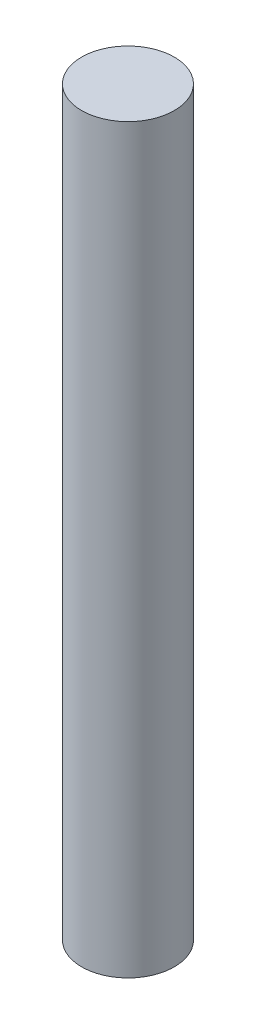
ISO-10303-21;
HEADER;
FILE_DESCRIPTION(('STEP AP214'),'2;1');
FILE_NAME('part.step','',(''),(''),'','','');
FILE_SCHEMA(('AUTOMOTIVE_DESIGN { 1 0 10303 214 1 1 1 1 }'));
ENDSEC;
DATA;
#1=APPLICATION_CONTEXT('core data for automotive mechanical design processes');
#2=APPLICATION_PROTOCOL_DEFINITION('international standard','automotive_design',2000,#1);
#3=PRODUCT_CONTEXT('',#1,'mechanical');
#4=PRODUCT('Part','Part','',(#3));
#5=PRODUCT_RELATED_PRODUCT_CATEGORY('part','',(#4));
#6=PRODUCT_DEFINITION_FORMATION('','',#4);
#7=PRODUCT_DEFINITION_CONTEXT('part definition',#1,'design');
#8=PRODUCT_DEFINITION('design','',#6,#7);
#9=PRODUCT_DEFINITION_SHAPE('','',#8);
#10=(LENGTH_UNIT() NAMED_UNIT(*) SI_UNIT(.MILLI.,.METRE.));
#11=(NAMED_UNIT(*) PLANE_ANGLE_UNIT() SI_UNIT($,.RADIAN.));
#12=(NAMED_UNIT(*) SI_UNIT($,.STERADIAN.) SOLID_ANGLE_UNIT());
#13=UNCERTAINTY_MEASURE_WITH_UNIT(LENGTH_MEASURE(1.E-05),#10,'distance_accuracy_value','');
#14=(GEOMETRIC_REPRESENTATION_CONTEXT(3) GLOBAL_UNCERTAINTY_ASSIGNED_CONTEXT((#13)) GLOBAL_UNIT_ASSIGNED_CONTEXT((#10,
#11,#12)) REPRESENTATION_CONTEXT('',''));
#15=CARTESIAN_POINT('',(0.,0.,0.));
#16=DIRECTION('',(0.,0.,1.));
#17=DIRECTION('',(1.,0.,0.));
#18=AXIS2_PLACEMENT_3D('',#15,#16,#17);
#19=CARTESIAN_POINT('',(0.,76.2,0.));
#20=DIRECTION('',(0.,-0.999999999999994,0.));
#21=DIRECTION('',(1.,0.,0.));
#22=AXIS2_PLACEMENT_3D('',#19,#20,#21);
#23=PLANE('',#22);
#24=CARTESIAN_POINT('',(0.,76.2,0.));
#25=DIRECTION('',(0.,0.999999999999994,0.));
#26=DIRECTION('',(-1.,0.,0.));
#27=AXIS2_PLACEMENT_3D('',#24,#25,#26);
#28=CIRCLE('',#27,9.525);
#29=CARTESIAN_POINT('',(-9.525,76.2,0.));
#30=VERTEX_POINT('',#29);
#31=EDGE_CURVE('E10',#30,#30,#28,.T.);
#32=ORIENTED_EDGE('',*,*,#31,.T.);
#33=EDGE_LOOP('',(#32));
#34=FACE_BOUND('',#33,.T.);
#35=ADVANCED_FACE('F51',(#34),#23,.F.);
#36=CARTESIAN_POINT('',(-2.22044604925031E-13,101.6,0.));
#37=DIRECTION('',(0.,0.999999999999994,0.));
#38=DIRECTION('',(-1.,0.,0.));
#39=AXIS2_PLACEMENT_3D('',#36,#37,#38);
#40=CYLINDRICAL_SURFACE('',#39,9.52500000000001);
#41=ORIENTED_EDGE('',*,*,#31,.F.);
#42=EDGE_LOOP('',(#41));
#43=FACE_BOUND('',#42,.T.);
#44=CARTESIAN_POINT('',(0.,-76.2,0.));
#45=DIRECTION('',(0.,0.999999999999994,0.));
#46=DIRECTION('',(-1.,0.,0.));
#47=AXIS2_PLACEMENT_3D('',#44,#45,#46);
#48=CIRCLE('',#47,9.52500000000002);
#49=CARTESIAN_POINT('',(-9.52500000000002,-76.2,0.));
#50=VERTEX_POINT('',#49);
#51=EDGE_CURVE('E58',#50,#50,#48,.T.);
#52=ORIENTED_EDGE('',*,*,#51,.T.);
#53=EDGE_LOOP('',(#52));
#54=FACE_BOUND('',#53,.T.);
#55=ADVANCED_FACE('F67',(#43,#54),#40,.T.);
#56=CARTESIAN_POINT('',(9.52500000000006,-76.2,0.));
#57=DIRECTION('',(0.,0.999999999999994,0.));
#58=DIRECTION('',(-1.,0.,0.));
#59=AXIS2_PLACEMENT_3D('',#56,#57,#58);
#60=PLANE('',#59);
#61=ORIENTED_EDGE('',*,*,#51,.F.);
#62=EDGE_LOOP('',(#61));
#63=FACE_BOUND('',#62,.T.);
#64=ADVANCED_FACE('F69',(#63),#60,.F.);
#65=CLOSED_SHELL('',(#35,#55,#64));
#66=MANIFOLD_SOLID_BREP('B2',#65);
#67=ADVANCED_BREP_SHAPE_REPRESENTATION('',(#18,#66),#14);
#68=SHAPE_DEFINITION_REPRESENTATION(#9,#67);
ENDSEC;
END-ISO-10303-21;
